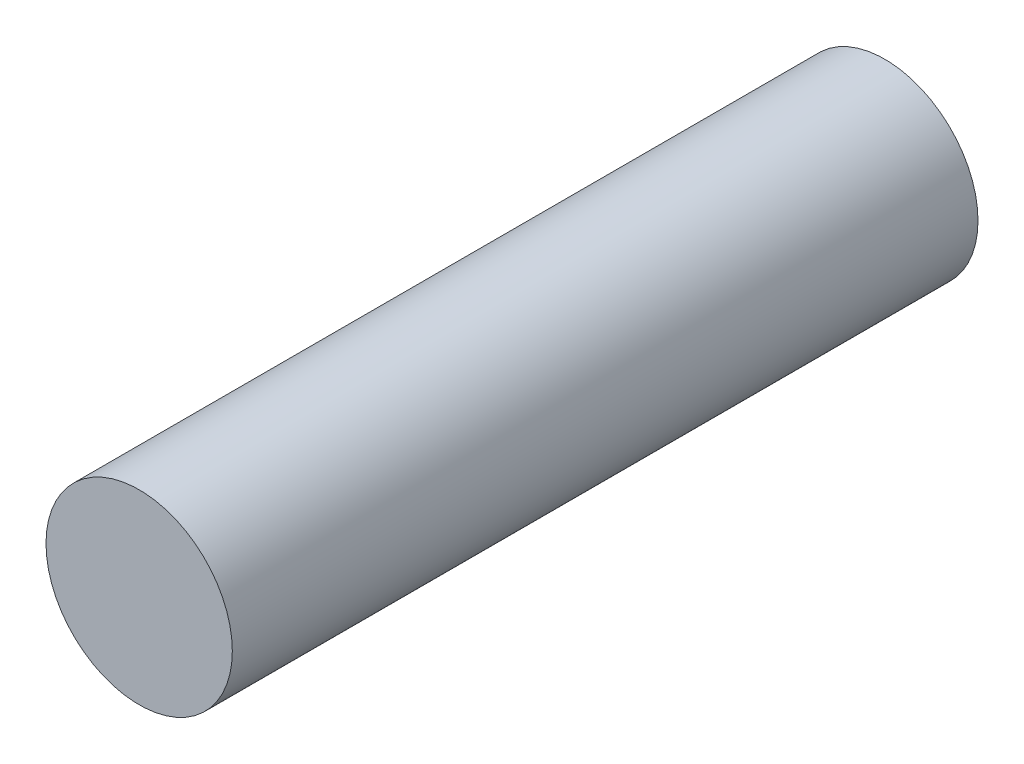
ISO-10303-21;
HEADER;
FILE_DESCRIPTION(('STEP AP214'),'2;1');
FILE_NAME('part.step','',(''),(''),'','','');
FILE_SCHEMA(('AUTOMOTIVE_DESIGN { 1 0 10303 214 1 1 1 1 }'));
ENDSEC;
DATA;
#1=APPLICATION_CONTEXT('core data for automotive mechanical design processes');
#2=APPLICATION_PROTOCOL_DEFINITION('international standard','automotive_design',2000,#1);
#3=PRODUCT_CONTEXT('',#1,'mechanical');
#4=PRODUCT('Part','Part','',(#3));
#5=PRODUCT_RELATED_PRODUCT_CATEGORY('part','',(#4));
#6=PRODUCT_DEFINITION_FORMATION('','',#4);
#7=PRODUCT_DEFINITION_CONTEXT('part definition',#1,'design');
#8=PRODUCT_DEFINITION('design','',#6,#7);
#9=PRODUCT_DEFINITION_SHAPE('','',#8);
#10=(LENGTH_UNIT() NAMED_UNIT(*) SI_UNIT(.MILLI.,.METRE.));
#11=(NAMED_UNIT(*) PLANE_ANGLE_UNIT() SI_UNIT($,.RADIAN.));
#12=(NAMED_UNIT(*) SI_UNIT($,.STERADIAN.) SOLID_ANGLE_UNIT());
#13=UNCERTAINTY_MEASURE_WITH_UNIT(LENGTH_MEASURE(1.E-05),#10,'distance_accuracy_value','');
#14=(GEOMETRIC_REPRESENTATION_CONTEXT(3) GLOBAL_UNCERTAINTY_ASSIGNED_CONTEXT((#13)) GLOBAL_UNIT_ASSIGNED_CONTEXT((#10,
#11,#12)) REPRESENTATION_CONTEXT('',''));
#15=CARTESIAN_POINT('',(0.,0.,0.));
#16=DIRECTION('',(0.,0.,1.));
#17=DIRECTION('',(1.,0.,0.));
#18=AXIS2_PLACEMENT_3D('',#15,#16,#17);
#19=CARTESIAN_POINT('',(0.,0.,38.1));
#20=DIRECTION('',(0.,0.,-1.));
#21=DIRECTION('',(-1.,0.,0.));
#22=AXIS2_PLACEMENT_3D('',#19,#20,#21);
#23=CYLINDRICAL_SURFACE('',#22,4.76);
#24=CARTESIAN_POINT('',(0.,0.,38.1));
#25=DIRECTION('',(0.,0.,1.));
#26=DIRECTION('',(1.,0.,0.));
#27=AXIS2_PLACEMENT_3D('',#24,#25,#26);
#28=CIRCLE('',#27,4.76);
#29=CARTESIAN_POINT('',(4.76,0.,38.1));
#30=VERTEX_POINT('',#29);
#31=EDGE_CURVE('E10',#30,#30,#28,.T.);
#32=ORIENTED_EDGE('',*,*,#31,.F.);
#33=EDGE_LOOP('',(#32));
#34=FACE_BOUND('',#33,.T.);
#35=CARTESIAN_POINT('',(0.,0.,0.));
#36=DIRECTION('',(0.,0.,1.));
#37=DIRECTION('',(1.,0.,0.));
#38=AXIS2_PLACEMENT_3D('',#35,#36,#37);
#39=CIRCLE('',#38,4.76);
#40=CARTESIAN_POINT('',(4.76,0.,0.));
#41=VERTEX_POINT('',#40);
#42=EDGE_CURVE('E34',#41,#41,#39,.T.);
#43=ORIENTED_EDGE('',*,*,#42,.T.);
#44=EDGE_LOOP('',(#43));
#45=FACE_BOUND('',#44,.T.);
#46=ADVANCED_FACE('F31',(#34,#45),#23,.T.);
#47=CARTESIAN_POINT('',(0.,0.,38.1));
#48=DIRECTION('',(0.,0.,1.));
#49=DIRECTION('',(1.,0.,0.));
#50=AXIS2_PLACEMENT_3D('',#47,#48,#49);
#51=PLANE('',#50);
#52=ORIENTED_EDGE('',*,*,#31,.T.);
#53=EDGE_LOOP('',(#52));
#54=FACE_BOUND('',#53,.T.);
#55=ADVANCED_FACE('F46',(#54),#51,.T.);
#56=CARTESIAN_POINT('',(0.,0.,0.));
#57=DIRECTION('',(0.,0.,1.));
#58=DIRECTION('',(1.,0.,0.));
#59=AXIS2_PLACEMENT_3D('',#56,#57,#58);
#60=PLANE('',#59);
#61=ORIENTED_EDGE('',*,*,#42,.F.);
#62=EDGE_LOOP('',(#61));
#63=FACE_BOUND('',#62,.T.);
#64=ADVANCED_FACE('F44',(#63),#60,.F.);
#65=CLOSED_SHELL('',(#46,#55,#64));
#66=MANIFOLD_SOLID_BREP('B2',#65);
#67=ADVANCED_BREP_SHAPE_REPRESENTATION('',(#18,#66),#14);
#68=SHAPE_DEFINITION_REPRESENTATION(#9,#67);
ENDSEC;
END-ISO-10303-21;
